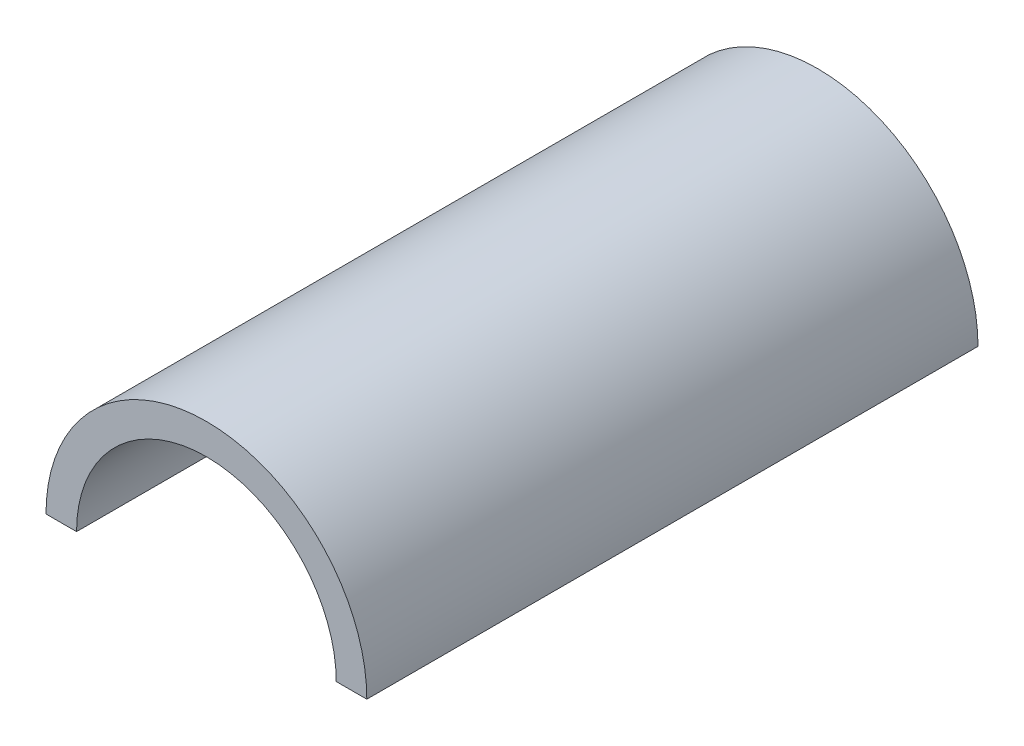
ISO-10303-21;
HEADER;
FILE_DESCRIPTION(('STEP AP214'),'2;1');
FILE_NAME('part.step','',(''),(''),'','','');
FILE_SCHEMA(('AUTOMOTIVE_DESIGN { 1 0 10303 214 1 1 1 1 }'));
ENDSEC;
DATA;
#1=APPLICATION_CONTEXT('core data for automotive mechanical design processes');
#2=APPLICATION_PROTOCOL_DEFINITION('international standard','automotive_design',2000,#1);
#3=PRODUCT_CONTEXT('',#1,'mechanical');
#4=PRODUCT('Part','Part','',(#3));
#5=PRODUCT_RELATED_PRODUCT_CATEGORY('part','',(#4));
#6=PRODUCT_DEFINITION_FORMATION('','',#4);
#7=PRODUCT_DEFINITION_CONTEXT('part definition',#1,'design');
#8=PRODUCT_DEFINITION('design','',#6,#7);
#9=PRODUCT_DEFINITION_SHAPE('','',#8);
#10=(LENGTH_UNIT() NAMED_UNIT(*) SI_UNIT(.MILLI.,.METRE.));
#11=(NAMED_UNIT(*) PLANE_ANGLE_UNIT() SI_UNIT($,.RADIAN.));
#12=(NAMED_UNIT(*) SI_UNIT($,.STERADIAN.) SOLID_ANGLE_UNIT());
#13=UNCERTAINTY_MEASURE_WITH_UNIT(LENGTH_MEASURE(1.E-05),#10,'distance_accuracy_value','');
#14=(GEOMETRIC_REPRESENTATION_CONTEXT(3) GLOBAL_UNCERTAINTY_ASSIGNED_CONTEXT((#13)) GLOBAL_UNIT_ASSIGNED_CONTEXT((#10,
#11,#12)) REPRESENTATION_CONTEXT('',''));
#15=CARTESIAN_POINT('',(0.,0.,0.));
#16=DIRECTION('',(0.,0.,1.));
#17=DIRECTION('',(1.,0.,0.));
#18=AXIS2_PLACEMENT_3D('',#15,#16,#17);
#19=CARTESIAN_POINT('',(-7.86440271613198,7.71201367464286,139.7));
#20=DIRECTION('',(0.,0.,-1.));
#21=DIRECTION('',(-1.,0.,0.));
#22=AXIS2_PLACEMENT_3D('',#19,#20,#21);
#23=CYLINDRICAL_SURFACE('',#22,36.6649);
#24=CARTESIAN_POINT('',(-7.86440271613198,7.71201367464286,0.));
#25=DIRECTION('',(0.,0.,1.));
#26=DIRECTION('',(-1.,0.,0.));
#27=AXIS2_PLACEMENT_3D('',#24,#25,#26);
#28=CIRCLE('',#27,36.6649);
#29=CARTESIAN_POINT('',(28.800497283868,7.71201367464286,0.));
#30=VERTEX_POINT('',#29);
#31=CARTESIAN_POINT('',(-44.529302716132,7.71201367464286,0.));
#32=VERTEX_POINT('',#31);
#33=EDGE_CURVE('E182',#30,#32,#28,.T.);
#34=ORIENTED_EDGE('',*,*,#33,.T.);
#35=DIRECTION('',(0.,0.,-1.));
#36=VECTOR('',#35,1.);
#37=CARTESIAN_POINT('',(-44.529302716132,7.71201367464286,139.7));
#38=LINE('',#37,#36);
#39=CARTESIAN_POINT('',(-44.529302716132,7.71201367464286,139.7));
#40=VERTEX_POINT('',#39);
#41=EDGE_CURVE('E11',#40,#32,#38,.T.);
#42=ORIENTED_EDGE('',*,*,#41,.F.);
#43=CARTESIAN_POINT('',(-7.86440271613198,7.71201367464286,139.7));
#44=DIRECTION('',(0.,0.,1.));
#45=DIRECTION('',(-1.,0.,0.));
#46=AXIS2_PLACEMENT_3D('',#43,#44,#45);
#47=CIRCLE('',#46,36.6649);
#48=CARTESIAN_POINT('',(28.800497283868,7.71201367464286,139.7));
#49=VERTEX_POINT('',#48);
#50=EDGE_CURVE('E183',#49,#40,#47,.T.);
#51=ORIENTED_EDGE('',*,*,#50,.F.);
#52=DIRECTION('',(0.,0.,-1.));
#53=VECTOR('',#52,1.);
#54=CARTESIAN_POINT('',(28.800497283868,7.71201367464286,139.7));
#55=LINE('',#54,#53);
#56=EDGE_CURVE('E189',#49,#30,#55,.T.);
#57=ORIENTED_EDGE('',*,*,#56,.T.);
#58=EDGE_LOOP('',(#34,#42,#51,#57));
#59=FACE_BOUND('',#58,.T.);
#60=ADVANCED_FACE('F35',(#59),#23,.T.);
#61=CARTESIAN_POINT('',(-37.544302716132,7.71201367464286,139.7));
#62=DIRECTION('',(0.,1.,0.));
#63=DIRECTION('',(-1.,0.,0.));
#64=AXIS2_PLACEMENT_3D('',#61,#62,#63);
#65=PLANE('',#64);
#66=CARTESIAN_POINT('',(-41.036802716132,7.71201367464286,30.48));
#67=DIRECTION('',(0.,-1.,0.));
#68=DIRECTION('',(0.,0.,-1.));
#69=AXIS2_PLACEMENT_3D('',#66,#67,#68);
#70=CIRCLE('',#69,1.5875);
#71=CARTESIAN_POINT('',(-41.036802716132,7.71201367464286,28.8925));
#72=VERTEX_POINT('',#71);
#73=EDGE_CURVE('E124',#72,#72,#70,.T.);
#74=ORIENTED_EDGE('',*,*,#73,.F.);
#75=EDGE_LOOP('',(#74));
#76=FACE_BOUND('',#75,.T.);
#77=CARTESIAN_POINT('',(-41.036802716132,7.71201367464286,41.91));
#78=DIRECTION('',(0.,-1.,0.));
#79=DIRECTION('',(0.,0.,-1.));
#80=AXIS2_PLACEMENT_3D('',#77,#78,#79);
#81=CIRCLE('',#80,1.5875);
#82=CARTESIAN_POINT('',(-41.036802716132,7.71201367464286,40.3225));
#83=VERTEX_POINT('',#82);
#84=EDGE_CURVE('E134',#83,#83,#81,.T.);
#85=ORIENTED_EDGE('',*,*,#84,.F.);
#86=EDGE_LOOP('',(#85));
#87=FACE_BOUND('',#86,.T.);
#88=CARTESIAN_POINT('',(-41.036802716132,7.71201367464286,53.34));
#89=DIRECTION('',(0.,-1.,0.));
#90=DIRECTION('',(0.,0.,-1.));
#91=AXIS2_PLACEMENT_3D('',#88,#89,#90);
#92=CIRCLE('',#91,1.5875);
#93=CARTESIAN_POINT('',(-41.036802716132,7.71201367464286,51.7525));
#94=VERTEX_POINT('',#93);
#95=EDGE_CURVE('E146',#94,#94,#92,.T.);
#96=ORIENTED_EDGE('',*,*,#95,.F.);
#97=EDGE_LOOP('',(#96));
#98=FACE_BOUND('',#97,.T.);
#99=CARTESIAN_POINT('',(-41.036802716132,7.71201367464286,64.77));
#100=DIRECTION('',(0.,-1.,0.));
#101=DIRECTION('',(0.,0.,-1.));
#102=AXIS2_PLACEMENT_3D('',#99,#100,#101);
#103=CIRCLE('',#102,1.5875);
#104=CARTESIAN_POINT('',(-41.036802716132,7.71201367464286,63.1825));
#105=VERTEX_POINT('',#104);
#106=EDGE_CURVE('E158',#105,#105,#103,.T.);
#107=ORIENTED_EDGE('',*,*,#106,.F.);
#108=EDGE_LOOP('',(#107));
#109=FACE_BOUND('',#108,.T.);
#110=CARTESIAN_POINT('',(-41.036802716132,7.71201367464286,76.2));
#111=DIRECTION('',(0.,-1.,0.));
#112=DIRECTION('',(0.,0.,-1.));
#113=AXIS2_PLACEMENT_3D('',#110,#111,#112);
#114=CIRCLE('',#113,1.5875);
#115=CARTESIAN_POINT('',(-41.036802716132,7.71201367464286,74.6125));
#116=VERTEX_POINT('',#115);
#117=EDGE_CURVE('E170',#116,#116,#114,.T.);
#118=ORIENTED_EDGE('',*,*,#117,.F.);
#119=EDGE_LOOP('',(#118));
#120=FACE_BOUND('',#119,.T.);
#121=DIRECTION('',(1.,0.,0.));
#122=VECTOR('',#121,1.);
#123=CARTESIAN_POINT('',(-37.544302716132,7.71201367464286,0.));
#124=LINE('',#123,#122);
#125=CARTESIAN_POINT('',(-37.544302716132,7.71201367464286,0.));
#126=VERTEX_POINT('',#125);
#127=EDGE_CURVE('E192',#32,#126,#124,.T.);
#128=ORIENTED_EDGE('',*,*,#127,.T.);
#129=DIRECTION('',(0.,0.,-1.));
#130=VECTOR('',#129,1.);
#131=CARTESIAN_POINT('',(-37.544302716132,7.71201367464286,139.7));
#132=LINE('',#131,#130);
#133=CARTESIAN_POINT('',(-37.544302716132,7.71201367464286,139.7));
#134=VERTEX_POINT('',#133);
#135=EDGE_CURVE('E43',#134,#126,#132,.T.);
#136=ORIENTED_EDGE('',*,*,#135,.F.);
#137=DIRECTION('',(1.,0.,0.));
#138=VECTOR('',#137,1.);
#139=CARTESIAN_POINT('',(-37.544302716132,7.71201367464286,139.7));
#140=LINE('',#139,#138);
#141=EDGE_CURVE('E82',#40,#134,#140,.T.);
#142=ORIENTED_EDGE('',*,*,#141,.F.);
#143=ORIENTED_EDGE('',*,*,#41,.T.);
#144=EDGE_LOOP('',(#128,#136,#142,#143));
#145=FACE_BOUND('',#144,.T.);
#146=ADVANCED_FACE('F216',(#76,#87,#98,#109,#120,#145),#65,.F.);
#147=CARTESIAN_POINT('',(-7.86440271613199,7.71201367464286,139.7));
#148=DIRECTION('',(0.,0.,-1.));
#149=DIRECTION('',(-1.,0.,0.));
#150=AXIS2_PLACEMENT_3D('',#147,#148,#149);
#151=CYLINDRICAL_SURFACE('',#150,29.6799);
#152=CARTESIAN_POINT('',(-7.86440271613199,7.71201367464286,0.));
#153=DIRECTION('',(0.,0.,-1.));
#154=DIRECTION('',(-1.,0.,0.));
#155=AXIS2_PLACEMENT_3D('',#152,#153,#154);
#156=CIRCLE('',#155,29.6799);
#157=CARTESIAN_POINT('',(21.815497283868,7.71201367464286,0.));
#158=VERTEX_POINT('',#157);
#159=EDGE_CURVE('E69',#126,#158,#156,.T.);
#160=ORIENTED_EDGE('',*,*,#159,.T.);
#161=DIRECTION('',(0.,0.,-1.));
#162=VECTOR('',#161,1.);
#163=CARTESIAN_POINT('',(21.815497283868,7.71201367464286,139.7));
#164=LINE('',#163,#162);
#165=CARTESIAN_POINT('',(21.815497283868,7.71201367464286,139.7));
#166=VERTEX_POINT('',#165);
#167=EDGE_CURVE('E197',#166,#158,#164,.T.);
#168=ORIENTED_EDGE('',*,*,#167,.F.);
#169=CARTESIAN_POINT('',(-7.86440271613199,7.71201367464286,139.7));
#170=DIRECTION('',(0.,0.,-1.));
#171=DIRECTION('',(-1.,0.,0.));
#172=AXIS2_PLACEMENT_3D('',#169,#170,#171);
#173=CIRCLE('',#172,29.6799);
#174=EDGE_CURVE('E186',#134,#166,#173,.T.);
#175=ORIENTED_EDGE('',*,*,#174,.F.);
#176=ORIENTED_EDGE('',*,*,#135,.T.);
#177=EDGE_LOOP('',(#160,#168,#175,#176));
#178=FACE_BOUND('',#177,.T.);
#179=ADVANCED_FACE('F199',(#178),#151,.F.);
#180=CARTESIAN_POINT('',(21.815497283868,7.71201367464286,139.7));
#181=DIRECTION('',(0.,1.,0.));
#182=DIRECTION('',(0.,0.,1.));
#183=AXIS2_PLACEMENT_3D('',#180,#181,#182);
#184=PLANE('',#183);
#185=CARTESIAN_POINT('',(25.307997283868,7.71201367464287,30.48));
#186=DIRECTION('',(0.,-1.,0.));
#187=DIRECTION('',(0.,0.,-1.));
#188=AXIS2_PLACEMENT_3D('',#185,#186,#187);
#189=CIRCLE('',#188,1.5875);
#190=CARTESIAN_POINT('',(25.307997283868,7.71201367464287,28.8925));
#191=VERTEX_POINT('',#190);
#192=EDGE_CURVE('E123',#191,#191,#189,.T.);
#193=ORIENTED_EDGE('',*,*,#192,.F.);
#194=EDGE_LOOP('',(#193));
#195=FACE_BOUND('',#194,.T.);
#196=CARTESIAN_POINT('',(25.307997283868,7.71201367464287,41.91));
#197=DIRECTION('',(0.,-1.,0.));
#198=DIRECTION('',(0.,0.,-1.));
#199=AXIS2_PLACEMENT_3D('',#196,#197,#198);
#200=CIRCLE('',#199,1.5875);
#201=CARTESIAN_POINT('',(25.307997283868,7.71201367464287,40.3225));
#202=VERTEX_POINT('',#201);
#203=EDGE_CURVE('E140',#202,#202,#200,.T.);
#204=ORIENTED_EDGE('',*,*,#203,.F.);
#205=EDGE_LOOP('',(#204));
#206=FACE_BOUND('',#205,.T.);
#207=CARTESIAN_POINT('',(25.307997283868,7.71201367464287,53.34));
#208=DIRECTION('',(0.,-1.,0.));
#209=DIRECTION('',(0.,0.,-1.));
#210=AXIS2_PLACEMENT_3D('',#207,#208,#209);
#211=CIRCLE('',#210,1.5875);
#212=CARTESIAN_POINT('',(25.307997283868,7.71201367464287,51.7525));
#213=VERTEX_POINT('',#212);
#214=EDGE_CURVE('E152',#213,#213,#211,.T.);
#215=ORIENTED_EDGE('',*,*,#214,.F.);
#216=EDGE_LOOP('',(#215));
#217=FACE_BOUND('',#216,.T.);
#218=CARTESIAN_POINT('',(25.307997283868,7.71201367464287,64.77));
#219=DIRECTION('',(0.,-1.,0.));
#220=DIRECTION('',(0.,0.,-1.));
#221=AXIS2_PLACEMENT_3D('',#218,#219,#220);
#222=CIRCLE('',#221,1.5875);
#223=CARTESIAN_POINT('',(25.307997283868,7.71201367464287,63.1825));
#224=VERTEX_POINT('',#223);
#225=EDGE_CURVE('E164',#224,#224,#222,.T.);
#226=ORIENTED_EDGE('',*,*,#225,.F.);
#227=EDGE_LOOP('',(#226));
#228=FACE_BOUND('',#227,.T.);
#229=CARTESIAN_POINT('',(25.307997283868,7.71201367464287,76.2));
#230=DIRECTION('',(0.,-1.,0.));
#231=DIRECTION('',(0.,0.,-1.));
#232=AXIS2_PLACEMENT_3D('',#229,#230,#231);
#233=CIRCLE('',#232,1.5875);
#234=CARTESIAN_POINT('',(25.307997283868,7.71201367464287,74.6125));
#235=VERTEX_POINT('',#234);
#236=EDGE_CURVE('E176',#235,#235,#233,.T.);
#237=ORIENTED_EDGE('',*,*,#236,.F.);
#238=EDGE_LOOP('',(#237));
#239=FACE_BOUND('',#238,.T.);
#240=DIRECTION('',(1.,0.,0.));
#241=VECTOR('',#240,1.);
#242=CARTESIAN_POINT('',(21.815497283868,7.71201367464286,0.));
#243=LINE('',#242,#241);
#244=EDGE_CURVE('E75',#158,#30,#243,.T.);
#245=ORIENTED_EDGE('',*,*,#244,.T.);
#246=ORIENTED_EDGE('',*,*,#56,.F.);
#247=DIRECTION('',(1.,0.,0.));
#248=VECTOR('',#247,1.);
#249=CARTESIAN_POINT('',(21.815497283868,7.71201367464286,139.7));
#250=LINE('',#249,#248);
#251=EDGE_CURVE('E51',#166,#49,#250,.T.);
#252=ORIENTED_EDGE('',*,*,#251,.F.);
#253=ORIENTED_EDGE('',*,*,#167,.T.);
#254=EDGE_LOOP('',(#245,#246,#252,#253));
#255=FACE_BOUND('',#254,.T.);
#256=ADVANCED_FACE('F206',(#195,#206,#217,#228,#239,#255),#184,.F.);
#257=CARTESIAN_POINT('',(-7.86440271613198,7.71201367464286,139.7));
#258=DIRECTION('',(0.,0.,-1.));
#259=DIRECTION('',(-1.,0.,0.));
#260=AXIS2_PLACEMENT_3D('',#257,#258,#259);
#261=PLANE('',#260);
#262=ORIENTED_EDGE('',*,*,#50,.T.);
#263=ORIENTED_EDGE('',*,*,#141,.T.);
#264=ORIENTED_EDGE('',*,*,#174,.T.);
#265=ORIENTED_EDGE('',*,*,#251,.T.);
#266=EDGE_LOOP('',(#262,#263,#264,#265));
#267=FACE_BOUND('',#266,.T.);
#268=ADVANCED_FACE('F208',(#267),#261,.F.);
#269=CARTESIAN_POINT('',(-7.86440271613198,7.71201367464286,0.));
#270=DIRECTION('',(0.,0.,-1.));
#271=DIRECTION('',(-1.,0.,0.));
#272=AXIS2_PLACEMENT_3D('',#269,#270,#271);
#273=PLANE('',#272);
#274=ORIENTED_EDGE('',*,*,#33,.F.);
#275=ORIENTED_EDGE('',*,*,#244,.F.);
#276=ORIENTED_EDGE('',*,*,#159,.F.);
#277=ORIENTED_EDGE('',*,*,#127,.F.);
#278=EDGE_LOOP('',(#274,#275,#276,#277));
#279=FACE_BOUND('',#278,.T.);
#280=ADVANCED_FACE('F202',(#279),#273,.T.);
#281=CARTESIAN_POINT('',(25.307997283868,8.21201367464287,76.2));
#282=DIRECTION('',(0.,-1.,0.));
#283=DIRECTION('',(0.,0.,-1.));
#284=AXIS2_PLACEMENT_3D('',#281,#282,#283);
#285=CONICAL_SURFACE('',#284,1.5875,1.02974425867665);
#286=CARTESIAN_POINT('',(25.307997283868,9.16587990734912,76.2));
#287=VERTEX_POINT('',#286);
#288=VERTEX_LOOP('',#287);
#289=FACE_BOUND('',#288,.T.);
#290=CARTESIAN_POINT('',(25.307997283868,8.21201367464287,76.2));
#291=DIRECTION('',(0.,-1.,0.));
#292=DIRECTION('',(0.,0.,-1.));
#293=AXIS2_PLACEMENT_3D('',#290,#291,#292);
#294=CIRCLE('',#293,1.5875);
#295=CARTESIAN_POINT('',(25.307997283868,8.21201367464287,74.6125));
#296=VERTEX_POINT('',#295);
#297=EDGE_CURVE('E179',#296,#296,#294,.T.);
#298=ORIENTED_EDGE('',*,*,#297,.T.);
#299=EDGE_LOOP('',(#298));
#300=FACE_BOUND('',#299,.T.);
#301=ADVANCED_FACE('F259',(#289,#300),#285,.F.);
#302=CARTESIAN_POINT('',(25.307997283868,7.71201367464287,76.2));
#303=DIRECTION('',(0.,-1.,0.));
#304=DIRECTION('',(0.,0.,-1.));
#305=AXIS2_PLACEMENT_3D('',#302,#303,#304);
#306=CYLINDRICAL_SURFACE('',#305,1.5875);
#307=ORIENTED_EDGE('',*,*,#297,.F.);
#308=EDGE_LOOP('',(#307));
#309=FACE_BOUND('',#308,.T.);
#310=ORIENTED_EDGE('',*,*,#236,.T.);
#311=EDGE_LOOP('',(#310));
#312=FACE_BOUND('',#311,.T.);
#313=ADVANCED_FACE('F251',(#309,#312),#306,.F.);
#314=CARTESIAN_POINT('',(-41.036802716132,8.21201367464286,76.2));
#315=DIRECTION('',(0.,-1.,0.));
#316=DIRECTION('',(0.,0.,-1.));
#317=AXIS2_PLACEMENT_3D('',#314,#315,#316);
#318=CONICAL_SURFACE('',#317,1.5875,1.02974425867665);
#319=CARTESIAN_POINT('',(-41.036802716132,9.16587990734911,76.2));
#320=VERTEX_POINT('',#319);
#321=VERTEX_LOOP('',#320);
#322=FACE_BOUND('',#321,.T.);
#323=CARTESIAN_POINT('',(-41.036802716132,8.21201367464286,76.2));
#324=DIRECTION('',(0.,-1.,0.));
#325=DIRECTION('',(0.,0.,-1.));
#326=AXIS2_PLACEMENT_3D('',#323,#324,#325);
#327=CIRCLE('',#326,1.5875);
#328=CARTESIAN_POINT('',(-41.036802716132,8.21201367464286,74.6125));
#329=VERTEX_POINT('',#328);
#330=EDGE_CURVE('E173',#329,#329,#327,.T.);
#331=ORIENTED_EDGE('',*,*,#330,.T.);
#332=EDGE_LOOP('',(#331));
#333=FACE_BOUND('',#332,.T.);
#334=ADVANCED_FACE('F241',(#322,#333),#318,.F.);
#335=CARTESIAN_POINT('',(-41.036802716132,7.71201367464286,76.2));
#336=DIRECTION('',(0.,-1.,0.));
#337=DIRECTION('',(0.,0.,-1.));
#338=AXIS2_PLACEMENT_3D('',#335,#336,#337);
#339=CYLINDRICAL_SURFACE('',#338,1.5875);
#340=ORIENTED_EDGE('',*,*,#330,.F.);
#341=EDGE_LOOP('',(#340));
#342=FACE_BOUND('',#341,.T.);
#343=ORIENTED_EDGE('',*,*,#117,.T.);
#344=EDGE_LOOP('',(#343));
#345=FACE_BOUND('',#344,.T.);
#346=ADVANCED_FACE('F238',(#342,#345),#339,.F.);
#347=CARTESIAN_POINT('',(25.307997283868,8.21201367464287,64.77));
#348=DIRECTION('',(0.,-1.,0.));
#349=DIRECTION('',(0.,0.,-1.));
#350=AXIS2_PLACEMENT_3D('',#347,#348,#349);
#351=CONICAL_SURFACE('',#350,1.5875,1.02974425867665);
#352=CARTESIAN_POINT('',(25.307997283868,9.16587990734912,64.77));
#353=VERTEX_POINT('',#352);
#354=VERTEX_LOOP('',#353);
#355=FACE_BOUND('',#354,.T.);
#356=CARTESIAN_POINT('',(25.307997283868,8.21201367464287,64.77));
#357=DIRECTION('',(0.,-1.,0.));
#358=DIRECTION('',(0.,0.,-1.));
#359=AXIS2_PLACEMENT_3D('',#356,#357,#358);
#360=CIRCLE('',#359,1.5875);
#361=CARTESIAN_POINT('',(25.307997283868,8.21201367464287,63.1825));
#362=VERTEX_POINT('',#361);
#363=EDGE_CURVE('E167',#362,#362,#360,.T.);
#364=ORIENTED_EDGE('',*,*,#363,.T.);
#365=EDGE_LOOP('',(#364));
#366=FACE_BOUND('',#365,.T.);
#367=ADVANCED_FACE('F240',(#355,#366),#351,.F.);
#368=CARTESIAN_POINT('',(25.307997283868,7.71201367464287,64.77));
#369=DIRECTION('',(0.,-1.,0.));
#370=DIRECTION('',(0.,0.,-1.));
#371=AXIS2_PLACEMENT_3D('',#368,#369,#370);
#372=CYLINDRICAL_SURFACE('',#371,1.5875);
#373=ORIENTED_EDGE('',*,*,#363,.F.);
#374=EDGE_LOOP('',(#373));
#375=FACE_BOUND('',#374,.T.);
#376=ORIENTED_EDGE('',*,*,#225,.T.);
#377=EDGE_LOOP('',(#376));
#378=FACE_BOUND('',#377,.T.);
#379=ADVANCED_FACE('F248',(#375,#378),#372,.F.);
#380=CARTESIAN_POINT('',(-41.036802716132,8.21201367464286,64.77));
#381=DIRECTION('',(0.,-1.,0.));
#382=DIRECTION('',(0.,0.,-1.));
#383=AXIS2_PLACEMENT_3D('',#380,#381,#382);
#384=CONICAL_SURFACE('',#383,1.5875,1.02974425867665);
#385=CARTESIAN_POINT('',(-41.036802716132,9.16587990734911,64.77));
#386=VERTEX_POINT('',#385);
#387=VERTEX_LOOP('',#386);
#388=FACE_BOUND('',#387,.T.);
#389=CARTESIAN_POINT('',(-41.036802716132,8.21201367464286,64.77));
#390=DIRECTION('',(0.,-1.,0.));
#391=DIRECTION('',(0.,0.,-1.));
#392=AXIS2_PLACEMENT_3D('',#389,#390,#391);
#393=CIRCLE('',#392,1.5875);
#394=CARTESIAN_POINT('',(-41.036802716132,8.21201367464286,63.1825));
#395=VERTEX_POINT('',#394);
#396=EDGE_CURVE('E161',#395,#395,#393,.T.);
#397=ORIENTED_EDGE('',*,*,#396,.T.);
#398=EDGE_LOOP('',(#397));
#399=FACE_BOUND('',#398,.T.);
#400=ADVANCED_FACE('F315',(#388,#399),#384,.F.);
#401=CARTESIAN_POINT('',(-41.036802716132,7.71201367464286,64.77));
#402=DIRECTION('',(0.,-1.,0.));
#403=DIRECTION('',(0.,0.,-1.));
#404=AXIS2_PLACEMENT_3D('',#401,#402,#403);
#405=CYLINDRICAL_SURFACE('',#404,1.5875);
#406=ORIENTED_EDGE('',*,*,#396,.F.);
#407=EDGE_LOOP('',(#406));
#408=FACE_BOUND('',#407,.T.);
#409=ORIENTED_EDGE('',*,*,#106,.T.);
#410=EDGE_LOOP('',(#409));
#411=FACE_BOUND('',#410,.T.);
#412=ADVANCED_FACE('F324',(#408,#411),#405,.F.);
#413=CARTESIAN_POINT('',(25.307997283868,8.21201367464287,53.34));
#414=DIRECTION('',(0.,-1.,0.));
#415=DIRECTION('',(0.,0.,-1.));
#416=AXIS2_PLACEMENT_3D('',#413,#414,#415);
#417=CONICAL_SURFACE('',#416,1.5875,1.02974425867665);
#418=CARTESIAN_POINT('',(25.307997283868,9.16587990734912,53.34));
#419=VERTEX_POINT('',#418);
#420=VERTEX_LOOP('',#419);
#421=FACE_BOUND('',#420,.T.);
#422=CARTESIAN_POINT('',(25.307997283868,8.21201367464287,53.34));
#423=DIRECTION('',(0.,-1.,0.));
#424=DIRECTION('',(0.,0.,-1.));
#425=AXIS2_PLACEMENT_3D('',#422,#423,#424);
#426=CIRCLE('',#425,1.5875);
#427=CARTESIAN_POINT('',(25.307997283868,8.21201367464287,51.7525));
#428=VERTEX_POINT('',#427);
#429=EDGE_CURVE('E155',#428,#428,#426,.T.);
#430=ORIENTED_EDGE('',*,*,#429,.T.);
#431=EDGE_LOOP('',(#430));
#432=FACE_BOUND('',#431,.T.);
#433=ADVANCED_FACE('F334',(#421,#432),#417,.F.);
#434=CARTESIAN_POINT('',(25.307997283868,7.71201367464287,53.34));
#435=DIRECTION('',(0.,-1.,0.));
#436=DIRECTION('',(0.,0.,-1.));
#437=AXIS2_PLACEMENT_3D('',#434,#435,#436);
#438=CYLINDRICAL_SURFACE('',#437,1.5875);
#439=ORIENTED_EDGE('',*,*,#429,.F.);
#440=EDGE_LOOP('',(#439));
#441=FACE_BOUND('',#440,.T.);
#442=ORIENTED_EDGE('',*,*,#214,.T.);
#443=EDGE_LOOP('',(#442));
#444=FACE_BOUND('',#443,.T.);
#445=ADVANCED_FACE('F344',(#441,#444),#438,.F.);
#446=CARTESIAN_POINT('',(-41.036802716132,8.21201367464286,53.34));
#447=DIRECTION('',(0.,-1.,0.));
#448=DIRECTION('',(0.,0.,-1.));
#449=AXIS2_PLACEMENT_3D('',#446,#447,#448);
#450=CONICAL_SURFACE('',#449,1.5875,1.02974425867665);
#451=CARTESIAN_POINT('',(-41.036802716132,9.16587990734911,53.34));
#452=VERTEX_POINT('',#451);
#453=VERTEX_LOOP('',#452);
#454=FACE_BOUND('',#453,.T.);
#455=CARTESIAN_POINT('',(-41.036802716132,8.21201367464286,53.34));
#456=DIRECTION('',(0.,-1.,0.));
#457=DIRECTION('',(0.,0.,-1.));
#458=AXIS2_PLACEMENT_3D('',#455,#456,#457);
#459=CIRCLE('',#458,1.5875);
#460=CARTESIAN_POINT('',(-41.036802716132,8.21201367464286,51.7525));
#461=VERTEX_POINT('',#460);
#462=EDGE_CURVE('E149',#461,#461,#459,.T.);
#463=ORIENTED_EDGE('',*,*,#462,.T.);
#464=EDGE_LOOP('',(#463));
#465=FACE_BOUND('',#464,.T.);
#466=ADVANCED_FACE('F354',(#454,#465),#450,.F.);
#467=CARTESIAN_POINT('',(-41.036802716132,7.71201367464286,53.34));
#468=DIRECTION('',(0.,-1.,0.));
#469=DIRECTION('',(0.,0.,-1.));
#470=AXIS2_PLACEMENT_3D('',#467,#468,#469);
#471=CYLINDRICAL_SURFACE('',#470,1.5875);
#472=ORIENTED_EDGE('',*,*,#462,.F.);
#473=EDGE_LOOP('',(#472));
#474=FACE_BOUND('',#473,.T.);
#475=ORIENTED_EDGE('',*,*,#95,.T.);
#476=EDGE_LOOP('',(#475));
#477=FACE_BOUND('',#476,.T.);
#478=ADVANCED_FACE('F364',(#474,#477),#471,.F.);
#479=CARTESIAN_POINT('',(25.307997283868,8.21201367464287,41.91));
#480=DIRECTION('',(0.,-1.,0.));
#481=DIRECTION('',(0.,0.,-1.));
#482=AXIS2_PLACEMENT_3D('',#479,#480,#481);
#483=CONICAL_SURFACE('',#482,1.5875,1.02974425867665);
#484=CARTESIAN_POINT('',(25.307997283868,9.16587990734912,41.91));
#485=VERTEX_POINT('',#484);
#486=VERTEX_LOOP('',#485);
#487=FACE_BOUND('',#486,.T.);
#488=CARTESIAN_POINT('',(25.307997283868,8.21201367464287,41.91));
#489=DIRECTION('',(0.,-1.,0.));
#490=DIRECTION('',(0.,0.,-1.));
#491=AXIS2_PLACEMENT_3D('',#488,#489,#490);
#492=CIRCLE('',#491,1.5875);
#493=CARTESIAN_POINT('',(25.307997283868,8.21201367464287,40.3225));
#494=VERTEX_POINT('',#493);
#495=EDGE_CURVE('E143',#494,#494,#492,.T.);
#496=ORIENTED_EDGE('',*,*,#495,.T.);
#497=EDGE_LOOP('',(#496));
#498=FACE_BOUND('',#497,.T.);
#499=ADVANCED_FACE('F374',(#487,#498),#483,.F.);
#500=CARTESIAN_POINT('',(25.307997283868,7.71201367464287,41.91));
#501=DIRECTION('',(0.,-1.,0.));
#502=DIRECTION('',(0.,0.,-1.));
#503=AXIS2_PLACEMENT_3D('',#500,#501,#502);
#504=CYLINDRICAL_SURFACE('',#503,1.5875);
#505=ORIENTED_EDGE('',*,*,#495,.F.);
#506=EDGE_LOOP('',(#505));
#507=FACE_BOUND('',#506,.T.);
#508=ORIENTED_EDGE('',*,*,#203,.T.);
#509=EDGE_LOOP('',(#508));
#510=FACE_BOUND('',#509,.T.);
#511=ADVANCED_FACE('F384',(#507,#510),#504,.F.);
#512=CARTESIAN_POINT('',(-41.036802716132,8.21201367464286,41.91));
#513=DIRECTION('',(0.,-1.,0.));
#514=DIRECTION('',(0.,0.,-1.));
#515=AXIS2_PLACEMENT_3D('',#512,#513,#514);
#516=CONICAL_SURFACE('',#515,1.5875,1.02974425867665);
#517=CARTESIAN_POINT('',(-41.036802716132,9.16587990734911,41.91));
#518=VERTEX_POINT('',#517);
#519=VERTEX_LOOP('',#518);
#520=FACE_BOUND('',#519,.T.);
#521=CARTESIAN_POINT('',(-41.036802716132,8.21201367464286,41.91));
#522=DIRECTION('',(0.,-1.,0.));
#523=DIRECTION('',(0.,0.,-1.));
#524=AXIS2_PLACEMENT_3D('',#521,#522,#523);
#525=CIRCLE('',#524,1.5875);
#526=CARTESIAN_POINT('',(-41.036802716132,8.21201367464286,40.3225));
#527=VERTEX_POINT('',#526);
#528=EDGE_CURVE('E137',#527,#527,#525,.T.);
#529=ORIENTED_EDGE('',*,*,#528,.T.);
#530=EDGE_LOOP('',(#529));
#531=FACE_BOUND('',#530,.T.);
#532=ADVANCED_FACE('F394',(#520,#531),#516,.F.);
#533=CARTESIAN_POINT('',(-41.036802716132,7.71201367464286,41.91));
#534=DIRECTION('',(0.,-1.,0.));
#535=DIRECTION('',(0.,0.,-1.));
#536=AXIS2_PLACEMENT_3D('',#533,#534,#535);
#537=CYLINDRICAL_SURFACE('',#536,1.5875);
#538=ORIENTED_EDGE('',*,*,#528,.F.);
#539=EDGE_LOOP('',(#538));
#540=FACE_BOUND('',#539,.T.);
#541=ORIENTED_EDGE('',*,*,#84,.T.);
#542=EDGE_LOOP('',(#541));
#543=FACE_BOUND('',#542,.T.);
#544=ADVANCED_FACE('F404',(#540,#543),#537,.F.);
#545=CARTESIAN_POINT('',(25.307997283868,8.21201367464287,30.48));
#546=DIRECTION('',(0.,-1.,0.));
#547=DIRECTION('',(0.,0.,-1.));
#548=AXIS2_PLACEMENT_3D('',#545,#546,#547);
#549=CONICAL_SURFACE('',#548,1.5875,1.02974425867665);
#550=CARTESIAN_POINT('',(25.307997283868,9.16587990734912,30.48));
#551=VERTEX_POINT('',#550);
#552=VERTEX_LOOP('',#551);
#553=FACE_BOUND('',#552,.T.);
#554=CARTESIAN_POINT('',(25.307997283868,8.21201367464287,30.48));
#555=DIRECTION('',(0.,-1.,0.));
#556=DIRECTION('',(0.,0.,-1.));
#557=AXIS2_PLACEMENT_3D('',#554,#555,#556);
#558=CIRCLE('',#557,1.5875);
#559=CARTESIAN_POINT('',(25.307997283868,8.21201367464287,28.8925));
#560=VERTEX_POINT('',#559);
#561=EDGE_CURVE('E127',#560,#560,#558,.T.);
#562=ORIENTED_EDGE('',*,*,#561,.T.);
#563=EDGE_LOOP('',(#562));
#564=FACE_BOUND('',#563,.T.);
#565=ADVANCED_FACE('F414',(#553,#564),#549,.F.);
#566=CARTESIAN_POINT('',(25.307997283868,7.71201367464287,30.48));
#567=DIRECTION('',(0.,-1.,0.));
#568=DIRECTION('',(0.,0.,-1.));
#569=AXIS2_PLACEMENT_3D('',#566,#567,#568);
#570=CYLINDRICAL_SURFACE('',#569,1.5875);
#571=ORIENTED_EDGE('',*,*,#561,.F.);
#572=EDGE_LOOP('',(#571));
#573=FACE_BOUND('',#572,.T.);
#574=ORIENTED_EDGE('',*,*,#192,.T.);
#575=EDGE_LOOP('',(#574));
#576=FACE_BOUND('',#575,.T.);
#577=ADVANCED_FACE('F117',(#573,#576),#570,.F.);
#578=CARTESIAN_POINT('',(-41.036802716132,8.21201367464286,30.48));
#579=DIRECTION('',(0.,-1.,0.));
#580=DIRECTION('',(0.,0.,-1.));
#581=AXIS2_PLACEMENT_3D('',#578,#579,#580);
#582=CONICAL_SURFACE('',#581,1.5875,1.02974425867665);
#583=CARTESIAN_POINT('',(-41.036802716132,9.16587990734911,30.48));
#584=VERTEX_POINT('',#583);
#585=VERTEX_LOOP('',#584);
#586=FACE_BOUND('',#585,.T.);
#587=CARTESIAN_POINT('',(-41.036802716132,8.21201367464286,30.48));
#588=DIRECTION('',(0.,-1.,0.));
#589=DIRECTION('',(0.,0.,-1.));
#590=AXIS2_PLACEMENT_3D('',#587,#588,#589);
#591=CIRCLE('',#590,1.5875);
#592=CARTESIAN_POINT('',(-41.036802716132,8.21201367464286,28.8925));
#593=VERTEX_POINT('',#592);
#594=EDGE_CURVE('E121',#593,#593,#591,.T.);
#595=ORIENTED_EDGE('',*,*,#594,.T.);
#596=EDGE_LOOP('',(#595));
#597=FACE_BOUND('',#596,.T.);
#598=ADVANCED_FACE('F113',(#586,#597),#582,.F.);
#599=CARTESIAN_POINT('',(-41.036802716132,7.71201367464286,30.48));
#600=DIRECTION('',(0.,-1.,0.));
#601=DIRECTION('',(0.,0.,-1.));
#602=AXIS2_PLACEMENT_3D('',#599,#600,#601);
#603=CYLINDRICAL_SURFACE('',#602,1.5875);
#604=ORIENTED_EDGE('',*,*,#594,.F.);
#605=EDGE_LOOP('',(#604));
#606=FACE_BOUND('',#605,.T.);
#607=ORIENTED_EDGE('',*,*,#73,.T.);
#608=EDGE_LOOP('',(#607));
#609=FACE_BOUND('',#608,.T.);
#610=ADVANCED_FACE('F116',(#606,#609),#603,.F.);
#611=CLOSED_SHELL('',(#60,#146,#179,#256,#268,#280,#301,#313,#334,#346,#367,#379,#400,#412,#433,
#445,#466,#478,#499,#511,#532,#544,#565,#577,#598,#610));
#612=MANIFOLD_SOLID_BREP('B2',#611);
#613=ADVANCED_BREP_SHAPE_REPRESENTATION('',(#18,#612),#14);
#614=SHAPE_DEFINITION_REPRESENTATION(#9,#613);
ENDSEC;
END-ISO-10303-21;
